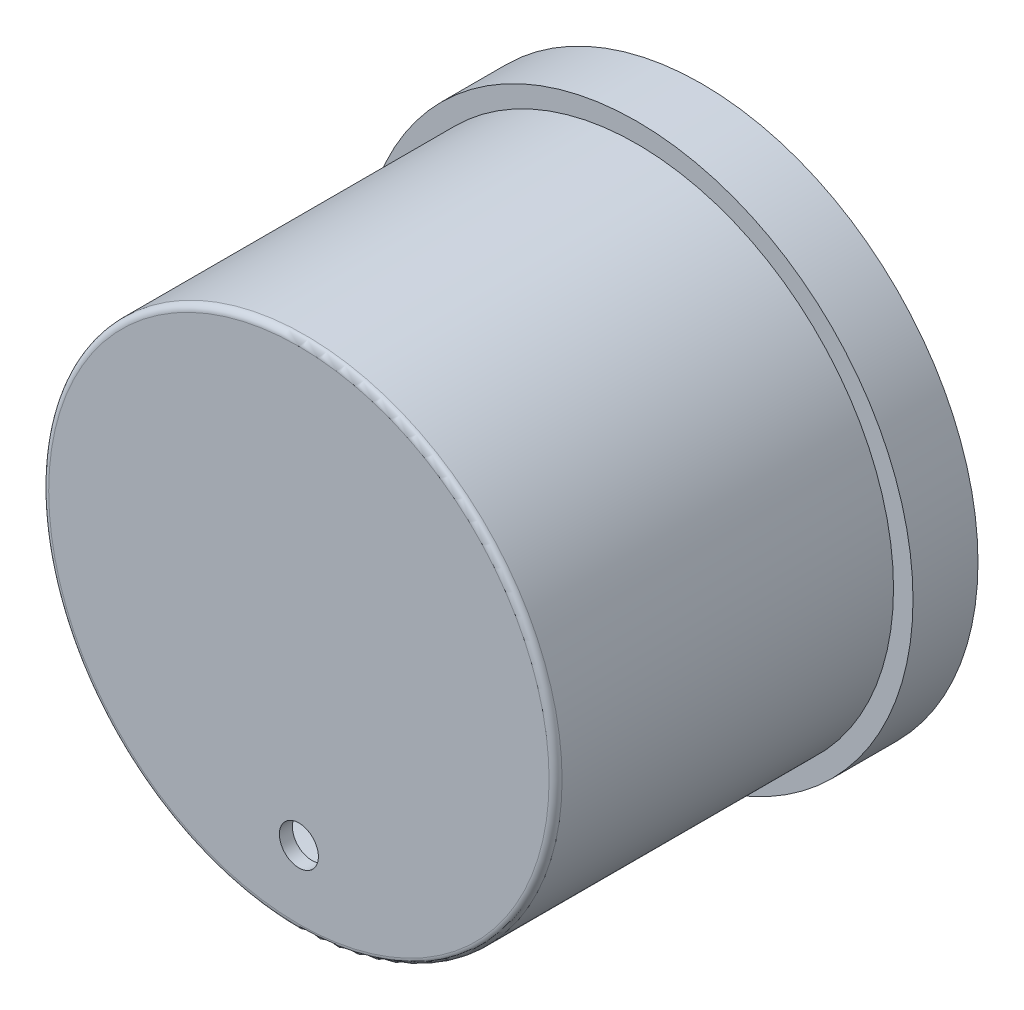
ISO-10303-21;
HEADER;
FILE_DESCRIPTION(('STEP AP214'),'2;1');
FILE_NAME('part.step','',(''),(''),'','','');
FILE_SCHEMA(('AUTOMOTIVE_DESIGN { 1 0 10303 214 1 1 1 1 }'));
ENDSEC;
DATA;
#1=APPLICATION_CONTEXT('core data for automotive mechanical design processes');
#2=APPLICATION_PROTOCOL_DEFINITION('international standard','automotive_design',2000,#1);
#3=PRODUCT_CONTEXT('',#1,'mechanical');
#4=PRODUCT('Part','Part','',(#3));
#5=PRODUCT_RELATED_PRODUCT_CATEGORY('part','',(#4));
#6=PRODUCT_DEFINITION_FORMATION('','',#4);
#7=PRODUCT_DEFINITION_CONTEXT('part definition',#1,'design');
#8=PRODUCT_DEFINITION('design','',#6,#7);
#9=PRODUCT_DEFINITION_SHAPE('','',#8);
#10=(LENGTH_UNIT() NAMED_UNIT(*) SI_UNIT(.MILLI.,.METRE.));
#11=(NAMED_UNIT(*) PLANE_ANGLE_UNIT() SI_UNIT($,.RADIAN.));
#12=(NAMED_UNIT(*) SI_UNIT($,.STERADIAN.) SOLID_ANGLE_UNIT());
#13=UNCERTAINTY_MEASURE_WITH_UNIT(LENGTH_MEASURE(1.E-05),#10,'distance_accuracy_value','');
#14=(GEOMETRIC_REPRESENTATION_CONTEXT(3) GLOBAL_UNCERTAINTY_ASSIGNED_CONTEXT((#13)) GLOBAL_UNIT_ASSIGNED_CONTEXT((#10,
#11,#12)) REPRESENTATION_CONTEXT('',''));
#15=CARTESIAN_POINT('',(0.,0.,0.));
#16=DIRECTION('',(0.,0.,1.));
#17=DIRECTION('',(1.,0.,0.));
#18=AXIS2_PLACEMENT_3D('',#15,#16,#17);
#19=CARTESIAN_POINT('',(0.,0.,10.));
#20=DIRECTION('',(0.,0.,1.));
#21=DIRECTION('',(1.,0.,0.));
#22=AXIS2_PLACEMENT_3D('',#19,#20,#21);
#23=PLANE('',#22);
#24=CARTESIAN_POINT('',(0.,0.,10.));
#25=DIRECTION('',(0.,0.,1.));
#26=DIRECTION('',(1.,0.,0.));
#27=AXIS2_PLACEMENT_3D('',#24,#25,#26);
#28=CIRCLE('',#27,42.5);
#29=CARTESIAN_POINT('',(42.5,0.,10.));
#30=VERTEX_POINT('',#29);
#31=EDGE_CURVE('E47',#30,#30,#28,.T.);
#32=ORIENTED_EDGE('',*,*,#31,.T.);
#33=EDGE_LOOP('',(#32));
#34=FACE_BOUND('',#33,.T.);
#35=CARTESIAN_POINT('',(0.,0.,10.));
#36=DIRECTION('',(0.,0.,1.));
#37=DIRECTION('',(1.,0.,0.));
#38=AXIS2_PLACEMENT_3D('',#35,#36,#37);
#39=CIRCLE('',#38,39.5);
#40=CARTESIAN_POINT('',(39.5,0.,10.));
#41=VERTEX_POINT('',#40);
#42=EDGE_CURVE('E59',#41,#41,#39,.T.);
#43=ORIENTED_EDGE('',*,*,#42,.F.);
#44=EDGE_LOOP('',(#43));
#45=FACE_BOUND('',#44,.T.);
#46=ADVANCED_FACE('F36',(#34,#45),#23,.T.);
#47=CARTESIAN_POINT('',(0.,0.,0.));
#48=DIRECTION('',(0.,0.,1.));
#49=DIRECTION('',(1.,0.,0.));
#50=AXIS2_PLACEMENT_3D('',#47,#48,#49);
#51=PLANE('',#50);
#52=CARTESIAN_POINT('',(0.,0.,0.));
#53=DIRECTION('',(0.,0.,1.));
#54=DIRECTION('',(1.,0.,0.));
#55=AXIS2_PLACEMENT_3D('',#52,#53,#54);
#56=CIRCLE('',#55,42.5);
#57=CARTESIAN_POINT('',(42.5,0.,0.));
#58=VERTEX_POINT('',#57);
#59=EDGE_CURVE('E51',#58,#58,#56,.T.);
#60=ORIENTED_EDGE('',*,*,#59,.F.);
#61=EDGE_LOOP('',(#60));
#62=FACE_BOUND('',#61,.T.);
#63=CARTESIAN_POINT('',(0.,0.,0.));
#64=DIRECTION('',(0.,0.,1.));
#65=DIRECTION('',(1.,0.,0.));
#66=AXIS2_PLACEMENT_3D('',#63,#64,#65);
#67=CIRCLE('',#66,37.5);
#68=CARTESIAN_POINT('',(37.5,0.,0.));
#69=VERTEX_POINT('',#68);
#70=EDGE_CURVE('E55',#69,#69,#67,.T.);
#71=ORIENTED_EDGE('',*,*,#70,.T.);
#72=EDGE_LOOP('',(#71));
#73=FACE_BOUND('',#72,.T.);
#74=ADVANCED_FACE('F89',(#62,#73),#51,.F.);
#75=CARTESIAN_POINT('',(0.,0.,10.));
#76=DIRECTION('',(0.,0.,-1.));
#77=DIRECTION('',(-1.,0.,0.));
#78=AXIS2_PLACEMENT_3D('',#75,#76,#77);
#79=CYLINDRICAL_SURFACE('',#78,42.5);
#80=ORIENTED_EDGE('',*,*,#31,.F.);
#81=EDGE_LOOP('',(#80));
#82=FACE_BOUND('',#81,.T.);
#83=ORIENTED_EDGE('',*,*,#59,.T.);
#84=EDGE_LOOP('',(#83));
#85=FACE_BOUND('',#84,.T.);
#86=ADVANCED_FACE('F95',(#82,#85),#79,.T.);
#87=CARTESIAN_POINT('',(0.,0.,10.));
#88=DIRECTION('',(0.,0.,-1.));
#89=DIRECTION('',(-1.,0.,0.));
#90=AXIS2_PLACEMENT_3D('',#87,#88,#89);
#91=CYLINDRICAL_SURFACE('',#90,37.5);
#92=ORIENTED_EDGE('',*,*,#70,.F.);
#93=EDGE_LOOP('',(#92));
#94=FACE_BOUND('',#93,.T.);
#95=CARTESIAN_POINT('',(0.,0.,60.));
#96=DIRECTION('',(0.,0.,1.));
#97=DIRECTION('',(1.,0.,0.));
#98=AXIS2_PLACEMENT_3D('',#95,#96,#97);
#99=CIRCLE('',#98,37.5);
#100=CARTESIAN_POINT('',(37.5,0.,60.));
#101=VERTEX_POINT('',#100);
#102=EDGE_CURVE('E62',#101,#101,#99,.T.);
#103=ORIENTED_EDGE('',*,*,#102,.T.);
#104=EDGE_LOOP('',(#103));
#105=FACE_BOUND('',#104,.T.);
#106=ADVANCED_FACE('F100',(#94,#105),#91,.F.);
#107=CARTESIAN_POINT('',(0.,0.,60.));
#108=DIRECTION('',(0.,0.,-1.));
#109=DIRECTION('',(-1.,0.,0.));
#110=AXIS2_PLACEMENT_3D('',#107,#108,#109);
#111=CYLINDRICAL_SURFACE('',#110,39.5);
#112=CARTESIAN_POINT('',(0.,0.,61.));
#113=DIRECTION('',(0.,0.,1.));
#114=DIRECTION('',(1.,0.,0.));
#115=AXIS2_PLACEMENT_3D('',#112,#113,#114);
#116=CIRCLE('',#115,39.5);
#117=CARTESIAN_POINT('',(39.5,0.,61.));
#118=VERTEX_POINT('',#117);
#119=EDGE_CURVE('E11',#118,#118,#116,.F.);
#120=ORIENTED_EDGE('',*,*,#119,.T.);
#121=EDGE_LOOP('',(#120));
#122=FACE_BOUND('',#121,.T.);
#123=ORIENTED_EDGE('',*,*,#42,.T.);
#124=EDGE_LOOP('',(#123));
#125=FACE_BOUND('',#124,.T.);
#126=ADVANCED_FACE('F84',(#122,#125),#111,.T.);
#127=CARTESIAN_POINT('',(0.,0.,60.));
#128=DIRECTION('',(0.,0.,1.));
#129=DIRECTION('',(1.,0.,0.));
#130=AXIS2_PLACEMENT_3D('',#127,#128,#129);
#131=PLANE('',#130);
#132=CARTESIAN_POINT('',(0.,-28.004064667957,60.));
#133=DIRECTION('',(0.,0.,1.));
#134=DIRECTION('',(1.,0.,0.));
#135=AXIS2_PLACEMENT_3D('',#132,#133,#134);
#136=CIRCLE('',#135,3.);
#137=CARTESIAN_POINT('',(3.,-28.004064667957,60.));
#138=VERTEX_POINT('',#137);
#139=EDGE_CURVE('E65',#138,#138,#136,.T.);
#140=ORIENTED_EDGE('',*,*,#139,.T.);
#141=EDGE_LOOP('',(#140));
#142=FACE_BOUND('',#141,.T.);
#143=ORIENTED_EDGE('',*,*,#102,.F.);
#144=EDGE_LOOP('',(#143));
#145=FACE_BOUND('',#144,.T.);
#146=ADVANCED_FACE('F77',(#142,#145),#131,.F.);
#147=CARTESIAN_POINT('',(0.,0.,62.));
#148=DIRECTION('',(0.,0.,1.));
#149=DIRECTION('',(1.,0.,0.));
#150=AXIS2_PLACEMENT_3D('',#147,#148,#149);
#151=PLANE('',#150);
#152=CARTESIAN_POINT('',(0.,-28.004064667957,62.));
#153=DIRECTION('',(0.,0.,1.));
#154=DIRECTION('',(1.,0.,0.));
#155=AXIS2_PLACEMENT_3D('',#152,#153,#154);
#156=CIRCLE('',#155,3.);
#157=CARTESIAN_POINT('',(3.,-28.004064667957,62.));
#158=VERTEX_POINT('',#157);
#159=EDGE_CURVE('E68',#158,#158,#156,.T.);
#160=ORIENTED_EDGE('',*,*,#159,.F.);
#161=EDGE_LOOP('',(#160));
#162=FACE_BOUND('',#161,.T.);
#163=CARTESIAN_POINT('',(0.,0.,62.));
#164=DIRECTION('',(0.,0.,1.));
#165=DIRECTION('',(1.,0.,0.));
#166=AXIS2_PLACEMENT_3D('',#163,#164,#165);
#167=CIRCLE('',#166,38.5);
#168=CARTESIAN_POINT('',(38.5,0.,62.));
#169=VERTEX_POINT('',#168);
#170=EDGE_CURVE('E43',#169,#169,#167,.T.);
#171=ORIENTED_EDGE('',*,*,#170,.T.);
#172=EDGE_LOOP('',(#171));
#173=FACE_BOUND('',#172,.T.);
#174=ADVANCED_FACE('F75',(#162,#173),#151,.T.);
#175=CARTESIAN_POINT('',(0.,0.,61.));
#176=DIRECTION('',(0.,0.,1.));
#177=DIRECTION('',(1.,0.,0.));
#178=AXIS2_PLACEMENT_3D('',#175,#176,#177);
#179=TOROIDAL_SURFACE('',#178,38.5,1.);
#180=ORIENTED_EDGE('',*,*,#119,.F.);
#181=EDGE_LOOP('',(#180));
#182=FACE_BOUND('',#181,.T.);
#183=ORIENTED_EDGE('',*,*,#170,.F.);
#184=EDGE_LOOP('',(#183));
#185=FACE_BOUND('',#184,.T.);
#186=ADVANCED_FACE('F38',(#182,#185),#179,.T.);
#187=CARTESIAN_POINT('',(0.,-28.004064667957,-38.));
#188=DIRECTION('',(0.,0.,1.));
#189=DIRECTION('',(1.,0.,0.));
#190=AXIS2_PLACEMENT_3D('',#187,#188,#189);
#191=CYLINDRICAL_SURFACE('',#190,3.);
#192=ORIENTED_EDGE('',*,*,#159,.T.);
#193=EDGE_LOOP('',(#192));
#194=FACE_BOUND('',#193,.T.);
#195=ORIENTED_EDGE('',*,*,#139,.F.);
#196=EDGE_LOOP('',(#195));
#197=FACE_BOUND('',#196,.T.);
#198=ADVANCED_FACE('F72',(#194,#197),#191,.F.);
#199=CLOSED_SHELL('',(#46,#74,#86,#106,#126,#146,#174,#186,#198));
#200=MANIFOLD_SOLID_BREP('B2',#199);
#201=ADVANCED_BREP_SHAPE_REPRESENTATION('',(#18,#200),#14);
#202=SHAPE_DEFINITION_REPRESENTATION(#9,#201);
ENDSEC;
END-ISO-10303-21;
